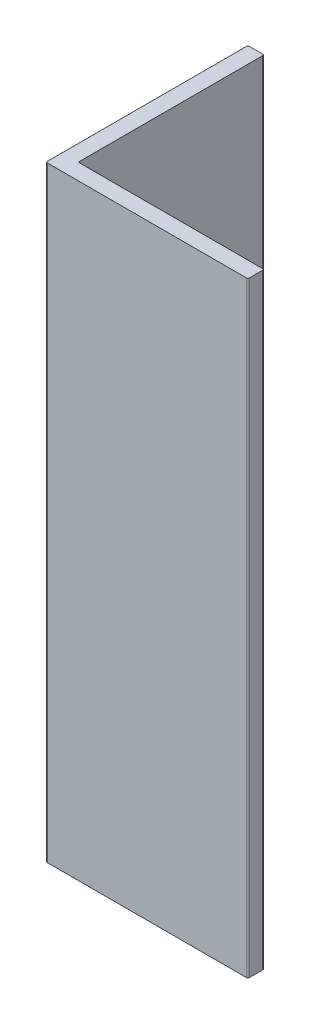
ISO-10303-21;
HEADER;
FILE_DESCRIPTION(('STEP AP214'),'2;1');
FILE_NAME('part.step','',(''),(''),'','','');
FILE_SCHEMA(('AUTOMOTIVE_DESIGN { 1 0 10303 214 1 1 1 1 }'));
ENDSEC;
DATA;
#1=APPLICATION_CONTEXT('core data for automotive mechanical design processes');
#2=APPLICATION_PROTOCOL_DEFINITION('international standard','automotive_design',2000,#1);
#3=PRODUCT_CONTEXT('',#1,'mechanical');
#4=PRODUCT('Part','Part','',(#3));
#5=PRODUCT_RELATED_PRODUCT_CATEGORY('part','',(#4));
#6=PRODUCT_DEFINITION_FORMATION('','',#4);
#7=PRODUCT_DEFINITION_CONTEXT('part definition',#1,'design');
#8=PRODUCT_DEFINITION('design','',#6,#7);
#9=PRODUCT_DEFINITION_SHAPE('','',#8);
#10=(LENGTH_UNIT() NAMED_UNIT(*) SI_UNIT(.MILLI.,.METRE.));
#11=(NAMED_UNIT(*) PLANE_ANGLE_UNIT() SI_UNIT($,.RADIAN.));
#12=(NAMED_UNIT(*) SI_UNIT($,.STERADIAN.) SOLID_ANGLE_UNIT());
#13=UNCERTAINTY_MEASURE_WITH_UNIT(LENGTH_MEASURE(1.E-05),#10,'distance_accuracy_value','');
#14=(GEOMETRIC_REPRESENTATION_CONTEXT(3) GLOBAL_UNCERTAINTY_ASSIGNED_CONTEXT((#13)) GLOBAL_UNIT_ASSIGNED_CONTEXT((#10,
#11,#12)) REPRESENTATION_CONTEXT('',''));
#15=CARTESIAN_POINT('',(0.,0.,0.));
#16=DIRECTION('',(0.,0.,1.));
#17=DIRECTION('',(1.,0.,0.));
#18=AXIS2_PLACEMENT_3D('',#15,#16,#17);
#19=CARTESIAN_POINT('',(0.,45.,0.));
#20=DIRECTION('',(1.,0.,0.));
#21=DIRECTION('',(0.,0.,-1.));
#22=AXIS2_PLACEMENT_3D('',#19,#20,#21);
#23=PLANE('',#22);
#24=DIRECTION('',(0.,0.,1.));
#25=VECTOR('',#24,1.);
#26=CARTESIAN_POINT('',(0.,45.,0.));
#27=LINE('',#26,#25);
#28=CARTESIAN_POINT('',(0.,45.,-14.9));
#29=VERTEX_POINT('',#28);
#30=CARTESIAN_POINT('',(0.,45.,-0.1));
#31=VERTEX_POINT('',#30);
#32=EDGE_CURVE('E141',#29,#31,#27,.T.);
#33=ORIENTED_EDGE('',*,*,#32,.F.);
#34=DIRECTION('',(0.,-1.,0.));
#35=VECTOR('',#34,1.);
#36=CARTESIAN_POINT('',(0.,45.,-14.9));
#37=LINE('',#36,#35);
#38=CARTESIAN_POINT('',(0.,0.,-14.9));
#39=VERTEX_POINT('',#38);
#40=EDGE_CURVE('E126',#29,#39,#37,.T.);
#41=ORIENTED_EDGE('',*,*,#40,.T.);
#42=DIRECTION('',(0.,0.,1.));
#43=VECTOR('',#42,1.);
#44=CARTESIAN_POINT('',(0.,0.,0.));
#45=LINE('',#44,#43);
#46=CARTESIAN_POINT('',(0.,0.,-0.1));
#47=VERTEX_POINT('',#46);
#48=EDGE_CURVE('E138',#39,#47,#45,.T.);
#49=ORIENTED_EDGE('',*,*,#48,.T.);
#50=DIRECTION('',(0.,-1.,0.));
#51=VECTOR('',#50,1.);
#52=CARTESIAN_POINT('',(0.,45.,-0.1));
#53=LINE('',#52,#51);
#54=EDGE_CURVE('E143',#47,#31,#53,.F.);
#55=ORIENTED_EDGE('',*,*,#54,.T.);
#56=EDGE_LOOP('',(#33,#41,#49,#55));
#57=FACE_BOUND('',#56,.T.);
#58=ADVANCED_FACE('F33',(#57),#23,.F.);
#59=CARTESIAN_POINT('',(0.,45.,0.));
#60=DIRECTION('',(0.,0.,-1.));
#61=DIRECTION('',(-1.,0.,0.));
#62=AXIS2_PLACEMENT_3D('',#59,#60,#61);
#63=PLANE('',#62);
#64=DIRECTION('',(1.,0.,0.));
#65=VECTOR('',#64,1.);
#66=CARTESIAN_POINT('',(0.,0.,0.));
#67=LINE('',#66,#65);
#68=CARTESIAN_POINT('',(0.1,0.,0.));
#69=VERTEX_POINT('',#68);
#70=CARTESIAN_POINT('',(14.9,0.,0.));
#71=VERTEX_POINT('',#70);
#72=EDGE_CURVE('E148',#69,#71,#67,.T.);
#73=ORIENTED_EDGE('',*,*,#72,.T.);
#74=DIRECTION('',(0.,-1.,0.));
#75=VECTOR('',#74,1.);
#76=CARTESIAN_POINT('',(14.9,45.,0.));
#77=LINE('',#76,#75);
#78=CARTESIAN_POINT('',(14.9,45.,0.));
#79=VERTEX_POINT('',#78);
#80=EDGE_CURVE('E202',#71,#79,#77,.F.);
#81=ORIENTED_EDGE('',*,*,#80,.T.);
#82=DIRECTION('',(1.,0.,0.));
#83=VECTOR('',#82,1.);
#84=CARTESIAN_POINT('',(0.,45.,0.));
#85=LINE('',#84,#83);
#86=CARTESIAN_POINT('',(0.1,45.,0.));
#87=VERTEX_POINT('',#86);
#88=EDGE_CURVE('E223',#87,#79,#85,.T.);
#89=ORIENTED_EDGE('',*,*,#88,.F.);
#90=DIRECTION('',(0.,-1.,0.));
#91=VECTOR('',#90,1.);
#92=CARTESIAN_POINT('',(0.1,45.,0.));
#93=LINE('',#92,#91);
#94=EDGE_CURVE('E199',#87,#69,#93,.T.);
#95=ORIENTED_EDGE('',*,*,#94,.T.);
#96=EDGE_LOOP('',(#73,#81,#89,#95));
#97=FACE_BOUND('',#96,.T.);
#98=ADVANCED_FACE('F233',(#97),#63,.F.);
#99=CARTESIAN_POINT('',(15.,45.,0.));
#100=DIRECTION('',(-1.,0.,0.));
#101=DIRECTION('',(0.,0.,1.));
#102=AXIS2_PLACEMENT_3D('',#99,#100,#101);
#103=PLANE('',#102);
#104=DIRECTION('',(0.,0.,-1.));
#105=VECTOR('',#104,1.);
#106=CARTESIAN_POINT('',(15.,0.,0.));
#107=LINE('',#106,#105);
#108=CARTESIAN_POINT('',(15.,0.,-0.0999999999999998));
#109=VERTEX_POINT('',#108);
#110=CARTESIAN_POINT('',(15.,0.,-1.1));
#111=VERTEX_POINT('',#110);
#112=EDGE_CURVE('E151',#109,#111,#107,.T.);
#113=ORIENTED_EDGE('',*,*,#112,.T.);
#114=DIRECTION('',(0.,-1.,0.));
#115=VECTOR('',#114,1.);
#116=CARTESIAN_POINT('',(15.,45.,-1.1));
#117=LINE('',#116,#115);
#118=CARTESIAN_POINT('',(15.,45.,-1.1));
#119=VERTEX_POINT('',#118);
#120=EDGE_CURVE('E197',#111,#119,#117,.F.);
#121=ORIENTED_EDGE('',*,*,#120,.T.);
#122=DIRECTION('',(0.,0.,-1.));
#123=VECTOR('',#122,1.);
#124=CARTESIAN_POINT('',(15.,45.,0.));
#125=LINE('',#124,#123);
#126=CARTESIAN_POINT('',(15.,45.,-0.0999999999999998));
#127=VERTEX_POINT('',#126);
#128=EDGE_CURVE('E218',#127,#119,#125,.T.);
#129=ORIENTED_EDGE('',*,*,#128,.F.);
#130=DIRECTION('',(0.,-1.,0.));
#131=VECTOR('',#130,1.);
#132=CARTESIAN_POINT('',(15.,45.,-0.0999999999999998));
#133=LINE('',#132,#131);
#134=EDGE_CURVE('E194',#127,#109,#133,.T.);
#135=ORIENTED_EDGE('',*,*,#134,.T.);
#136=EDGE_LOOP('',(#113,#121,#129,#135));
#137=FACE_BOUND('',#136,.T.);
#138=ADVANCED_FACE('F242',(#137),#103,.F.);
#139=CARTESIAN_POINT('',(15.,45.,-1.2));
#140=DIRECTION('',(0.,0.,1.));
#141=DIRECTION('',(1.,0.,0.));
#142=AXIS2_PLACEMENT_3D('',#139,#140,#141);
#143=PLANE('',#142);
#144=DIRECTION('',(-1.,0.,0.));
#145=VECTOR('',#144,1.);
#146=CARTESIAN_POINT('',(15.,0.,-1.2));
#147=LINE('',#146,#145);
#148=CARTESIAN_POINT('',(14.9,0.,-1.2));
#149=VERTEX_POINT('',#148);
#150=CARTESIAN_POINT('',(1.3,0.,-1.2));
#151=VERTEX_POINT('',#150);
#152=EDGE_CURVE('E159',#149,#151,#147,.T.);
#153=ORIENTED_EDGE('',*,*,#152,.T.);
#154=DIRECTION('',(0.,-1.,0.));
#155=VECTOR('',#154,1.);
#156=CARTESIAN_POINT('',(1.3,45.,-1.2));
#157=LINE('',#156,#155);
#158=CARTESIAN_POINT('',(1.3,45.,-1.2));
#159=VERTEX_POINT('',#158);
#160=EDGE_CURVE('E192',#151,#159,#157,.F.);
#161=ORIENTED_EDGE('',*,*,#160,.T.);
#162=DIRECTION('',(-1.,0.,0.));
#163=VECTOR('',#162,1.);
#164=CARTESIAN_POINT('',(15.,45.,-1.2));
#165=LINE('',#164,#163);
#166=CARTESIAN_POINT('',(14.9,45.,-1.2));
#167=VERTEX_POINT('',#166);
#168=EDGE_CURVE('E216',#167,#159,#165,.T.);
#169=ORIENTED_EDGE('',*,*,#168,.F.);
#170=DIRECTION('',(0.,-1.,0.));
#171=VECTOR('',#170,1.);
#172=CARTESIAN_POINT('',(14.9,45.,-1.2));
#173=LINE('',#172,#171);
#174=EDGE_CURVE('E189',#167,#149,#173,.T.);
#175=ORIENTED_EDGE('',*,*,#174,.T.);
#176=EDGE_LOOP('',(#153,#161,#169,#175));
#177=FACE_BOUND('',#176,.T.);
#178=ADVANCED_FACE('F209',(#177),#143,.F.);
#179=CARTESIAN_POINT('',(1.2,45.,-15.));
#180=DIRECTION('',(-1.,0.,0.));
#181=DIRECTION('',(0.,0.,1.));
#182=AXIS2_PLACEMENT_3D('',#179,#180,#181);
#183=PLANE('',#182);
#184=DIRECTION('',(0.,0.,-1.));
#185=VECTOR('',#184,1.);
#186=CARTESIAN_POINT('',(1.2,45.,-15.));
#187=LINE('',#186,#185);
#188=CARTESIAN_POINT('',(1.2,45.,-1.3));
#189=VERTEX_POINT('',#188);
#190=CARTESIAN_POINT('',(1.2,45.,-14.9));
#191=VERTEX_POINT('',#190);
#192=EDGE_CURVE('E214',#189,#191,#187,.T.);
#193=ORIENTED_EDGE('',*,*,#192,.F.);
#194=DIRECTION('',(0.,-1.,0.));
#195=VECTOR('',#194,1.);
#196=CARTESIAN_POINT('',(1.2,0.,-1.3));
#197=LINE('',#196,#195);
#198=CARTESIAN_POINT('',(1.2,0.,-1.3));
#199=VERTEX_POINT('',#198);
#200=EDGE_CURVE('E186',#189,#199,#197,.T.);
#201=ORIENTED_EDGE('',*,*,#200,.T.);
#202=DIRECTION('',(0.,0.,-1.));
#203=VECTOR('',#202,1.);
#204=CARTESIAN_POINT('',(1.2,0.,-15.));
#205=LINE('',#204,#203);
#206=CARTESIAN_POINT('',(1.2,0.,-14.9));
#207=VERTEX_POINT('',#206);
#208=EDGE_CURVE('E162',#199,#207,#205,.T.);
#209=ORIENTED_EDGE('',*,*,#208,.T.);
#210=DIRECTION('',(0.,-1.,0.));
#211=VECTOR('',#210,1.);
#212=CARTESIAN_POINT('',(1.2,45.,-14.9));
#213=LINE('',#212,#211);
#214=EDGE_CURVE('E48',#207,#191,#213,.F.);
#215=ORIENTED_EDGE('',*,*,#214,.T.);
#216=EDGE_LOOP('',(#193,#201,#209,#215));
#217=FACE_BOUND('',#216,.T.);
#218=ADVANCED_FACE('F213',(#217),#183,.F.);
#219=CARTESIAN_POINT('',(0.,45.,-15.));
#220=DIRECTION('',(0.,0.,1.));
#221=DIRECTION('',(1.,0.,0.));
#222=AXIS2_PLACEMENT_3D('',#219,#220,#221);
#223=PLANE('',#222);
#224=DIRECTION('',(-1.,0.,0.));
#225=VECTOR('',#224,1.);
#226=CARTESIAN_POINT('',(0.,0.,-15.));
#227=LINE('',#226,#225);
#228=CARTESIAN_POINT('',(1.1,0.,-15.));
#229=VERTEX_POINT('',#228);
#230=CARTESIAN_POINT('',(0.1,0.,-15.));
#231=VERTEX_POINT('',#230);
#232=EDGE_CURVE('E164',#229,#231,#227,.T.);
#233=ORIENTED_EDGE('',*,*,#232,.T.);
#234=DIRECTION('',(0.,-1.,0.));
#235=VECTOR('',#234,1.);
#236=CARTESIAN_POINT('',(0.1,45.,-15.));
#237=LINE('',#236,#235);
#238=CARTESIAN_POINT('',(0.1,45.,-15.));
#239=VERTEX_POINT('',#238);
#240=EDGE_CURVE('E127',#231,#239,#237,.F.);
#241=ORIENTED_EDGE('',*,*,#240,.T.);
#242=DIRECTION('',(-1.,0.,0.));
#243=VECTOR('',#242,1.);
#244=CARTESIAN_POINT('',(0.,45.,-15.));
#245=LINE('',#244,#243);
#246=CARTESIAN_POINT('',(1.1,45.,-15.));
#247=VERTEX_POINT('',#246);
#248=EDGE_CURVE('E154',#247,#239,#245,.T.);
#249=ORIENTED_EDGE('',*,*,#248,.F.);
#250=DIRECTION('',(0.,-1.,0.));
#251=VECTOR('',#250,1.);
#252=CARTESIAN_POINT('',(1.1,45.,-15.));
#253=LINE('',#252,#251);
#254=EDGE_CURVE('E132',#247,#229,#253,.T.);
#255=ORIENTED_EDGE('',*,*,#254,.T.);
#256=EDGE_LOOP('',(#233,#241,#249,#255));
#257=FACE_BOUND('',#256,.T.);
#258=ADVANCED_FACE('F271',(#257),#223,.F.);
#259=CARTESIAN_POINT('',(0.,45.,0.));
#260=DIRECTION('',(0.,-1.,0.));
#261=DIRECTION('',(0.,0.,-1.));
#262=AXIS2_PLACEMENT_3D('',#259,#260,#261);
#263=PLANE('',#262);
#264=ORIENTED_EDGE('',*,*,#248,.T.);
#265=CARTESIAN_POINT('',(0.1,45.,-14.9));
#266=DIRECTION('',(0.,-1.,0.));
#267=DIRECTION('',(0.,0.,-1.));
#268=AXIS2_PLACEMENT_3D('',#265,#266,#267);
#269=CIRCLE('',#268,0.1);
#270=EDGE_CURVE('E183',#239,#29,#269,.F.);
#271=ORIENTED_EDGE('',*,*,#270,.T.);
#272=ORIENTED_EDGE('',*,*,#32,.T.);
#273=CARTESIAN_POINT('',(0.1,45.,-0.1));
#274=DIRECTION('',(0.,-1.,0.));
#275=DIRECTION('',(0.,0.,-1.));
#276=AXIS2_PLACEMENT_3D('',#273,#274,#275);
#277=CIRCLE('',#276,0.1);
#278=EDGE_CURVE('E177',#31,#87,#277,.F.);
#279=ORIENTED_EDGE('',*,*,#278,.T.);
#280=ORIENTED_EDGE('',*,*,#88,.T.);
#281=CARTESIAN_POINT('',(14.9,45.,-0.1));
#282=DIRECTION('',(0.,-1.,0.));
#283=DIRECTION('',(0.,0.,-1.));
#284=AXIS2_PLACEMENT_3D('',#281,#282,#283);
#285=CIRCLE('',#284,0.1);
#286=EDGE_CURVE('E179',#79,#127,#285,.F.);
#287=ORIENTED_EDGE('',*,*,#286,.T.);
#288=ORIENTED_EDGE('',*,*,#128,.T.);
#289=CARTESIAN_POINT('',(14.9,45.,-1.1));
#290=DIRECTION('',(0.,-1.,0.));
#291=DIRECTION('',(0.,0.,-1.));
#292=AXIS2_PLACEMENT_3D('',#289,#290,#291);
#293=CIRCLE('',#292,0.1);
#294=EDGE_CURVE('E181',#119,#167,#293,.F.);
#295=ORIENTED_EDGE('',*,*,#294,.T.);
#296=ORIENTED_EDGE('',*,*,#168,.T.);
#297=CARTESIAN_POINT('',(1.3,45.,-1.3));
#298=DIRECTION('',(0.,-1.,0.));
#299=DIRECTION('',(0.,0.,-1.));
#300=AXIS2_PLACEMENT_3D('',#297,#298,#299);
#301=CIRCLE('',#300,0.1);
#302=EDGE_CURVE('E11',#159,#189,#301,.T.);
#303=ORIENTED_EDGE('',*,*,#302,.T.);
#304=ORIENTED_EDGE('',*,*,#192,.T.);
#305=CARTESIAN_POINT('',(1.1,45.,-14.9));
#306=DIRECTION('',(0.,-1.,0.));
#307=DIRECTION('',(0.,0.,-1.));
#308=AXIS2_PLACEMENT_3D('',#305,#306,#307);
#309=CIRCLE('',#308,0.1);
#310=EDGE_CURVE('E175',#191,#247,#309,.F.);
#311=ORIENTED_EDGE('',*,*,#310,.T.);
#312=EDGE_LOOP('',(#264,#271,#272,#279,#280,#287,#288,#295,#296,#303,#304,#311));
#313=FACE_BOUND('',#312,.T.);
#314=ADVANCED_FACE('F227',(#313),#263,.F.);
#315=CARTESIAN_POINT('',(0.,0.,0.));
#316=DIRECTION('',(0.,-1.,0.));
#317=DIRECTION('',(0.,0.,-1.));
#318=AXIS2_PLACEMENT_3D('',#315,#316,#317);
#319=PLANE('',#318);
#320=ORIENTED_EDGE('',*,*,#48,.F.);
#321=CARTESIAN_POINT('',(0.1,0.,-14.9));
#322=DIRECTION('',(0.,-1.,0.));
#323=DIRECTION('',(0.,0.,-1.));
#324=AXIS2_PLACEMENT_3D('',#321,#322,#323);
#325=CIRCLE('',#324,0.1);
#326=EDGE_CURVE('E122',#39,#231,#325,.T.);
#327=ORIENTED_EDGE('',*,*,#326,.T.);
#328=ORIENTED_EDGE('',*,*,#232,.F.);
#329=CARTESIAN_POINT('',(1.1,0.,-14.9));
#330=DIRECTION('',(0.,-1.,0.));
#331=DIRECTION('',(0.,0.,-1.));
#332=AXIS2_PLACEMENT_3D('',#329,#330,#331);
#333=CIRCLE('',#332,0.1);
#334=EDGE_CURVE('E142',#229,#207,#333,.T.);
#335=ORIENTED_EDGE('',*,*,#334,.T.);
#336=ORIENTED_EDGE('',*,*,#208,.F.);
#337=CARTESIAN_POINT('',(1.3,0.,-1.3));
#338=DIRECTION('',(0.,-1.,0.));
#339=DIRECTION('',(0.,0.,-1.));
#340=AXIS2_PLACEMENT_3D('',#337,#338,#339);
#341=CIRCLE('',#340,0.1);
#342=EDGE_CURVE('E41',#199,#151,#341,.F.);
#343=ORIENTED_EDGE('',*,*,#342,.T.);
#344=ORIENTED_EDGE('',*,*,#152,.F.);
#345=CARTESIAN_POINT('',(14.9,0.,-1.1));
#346=DIRECTION('',(0.,-1.,0.));
#347=DIRECTION('',(0.,0.,-1.));
#348=AXIS2_PLACEMENT_3D('',#345,#346,#347);
#349=CIRCLE('',#348,0.1);
#350=EDGE_CURVE('E133',#149,#111,#349,.T.);
#351=ORIENTED_EDGE('',*,*,#350,.T.);
#352=ORIENTED_EDGE('',*,*,#112,.F.);
#353=CARTESIAN_POINT('',(14.9,0.,-0.1));
#354=DIRECTION('',(0.,-1.,0.));
#355=DIRECTION('',(0.,0.,-1.));
#356=AXIS2_PLACEMENT_3D('',#353,#354,#355);
#357=CIRCLE('',#356,0.1);
#358=EDGE_CURVE('E169',#109,#71,#357,.T.);
#359=ORIENTED_EDGE('',*,*,#358,.T.);
#360=ORIENTED_EDGE('',*,*,#72,.F.);
#361=CARTESIAN_POINT('',(0.1,0.,-0.1));
#362=DIRECTION('',(0.,-1.,0.));
#363=DIRECTION('',(0.,0.,-1.));
#364=AXIS2_PLACEMENT_3D('',#361,#362,#363);
#365=CIRCLE('',#364,0.1);
#366=EDGE_CURVE('E147',#69,#47,#365,.T.);
#367=ORIENTED_EDGE('',*,*,#366,.T.);
#368=EDGE_LOOP('',(#320,#327,#328,#335,#336,#343,#344,#351,#352,#359,#360,#367));
#369=FACE_BOUND('',#368,.T.);
#370=ADVANCED_FACE('F145',(#369),#319,.T.);
#371=CARTESIAN_POINT('',(0.1,45.,-14.9));
#372=DIRECTION('',(0.,-1.,0.));
#373=DIRECTION('',(0.,0.,-1.));
#374=AXIS2_PLACEMENT_3D('',#371,#372,#373);
#375=CYLINDRICAL_SURFACE('',#374,0.1);
#376=ORIENTED_EDGE('',*,*,#270,.F.);
#377=ORIENTED_EDGE('',*,*,#240,.F.);
#378=ORIENTED_EDGE('',*,*,#326,.F.);
#379=ORIENTED_EDGE('',*,*,#40,.F.);
#380=EDGE_LOOP('',(#376,#377,#378,#379));
#381=FACE_BOUND('',#380,.T.);
#382=ADVANCED_FACE('F125',(#381),#375,.T.);
#383=CARTESIAN_POINT('',(1.3,45.,-1.3));
#384=DIRECTION('',(0.,1.,0.));
#385=DIRECTION('',(0.,0.,1.));
#386=AXIS2_PLACEMENT_3D('',#383,#384,#385);
#387=CYLINDRICAL_SURFACE('',#386,0.1);
#388=ORIENTED_EDGE('',*,*,#302,.F.);
#389=ORIENTED_EDGE('',*,*,#160,.F.);
#390=ORIENTED_EDGE('',*,*,#342,.F.);
#391=ORIENTED_EDGE('',*,*,#200,.F.);
#392=EDGE_LOOP('',(#388,#389,#390,#391));
#393=FACE_BOUND('',#392,.T.);
#394=ADVANCED_FACE('F212',(#393),#387,.F.);
#395=CARTESIAN_POINT('',(14.9,45.,-1.1));
#396=DIRECTION('',(0.,-1.,0.));
#397=DIRECTION('',(0.,0.,-1.));
#398=AXIS2_PLACEMENT_3D('',#395,#396,#397);
#399=CYLINDRICAL_SURFACE('',#398,0.1);
#400=ORIENTED_EDGE('',*,*,#294,.F.);
#401=ORIENTED_EDGE('',*,*,#120,.F.);
#402=ORIENTED_EDGE('',*,*,#350,.F.);
#403=ORIENTED_EDGE('',*,*,#174,.F.);
#404=EDGE_LOOP('',(#400,#401,#402,#403));
#405=FACE_BOUND('',#404,.T.);
#406=ADVANCED_FACE('F246',(#405),#399,.T.);
#407=CARTESIAN_POINT('',(14.9,45.,-0.1));
#408=DIRECTION('',(0.,-1.,0.));
#409=DIRECTION('',(0.,0.,-1.));
#410=AXIS2_PLACEMENT_3D('',#407,#408,#409);
#411=CYLINDRICAL_SURFACE('',#410,0.1);
#412=ORIENTED_EDGE('',*,*,#286,.F.);
#413=ORIENTED_EDGE('',*,*,#80,.F.);
#414=ORIENTED_EDGE('',*,*,#358,.F.);
#415=ORIENTED_EDGE('',*,*,#134,.F.);
#416=EDGE_LOOP('',(#412,#413,#414,#415));
#417=FACE_BOUND('',#416,.T.);
#418=ADVANCED_FACE('F239',(#417),#411,.T.);
#419=CARTESIAN_POINT('',(0.1,45.,-0.1));
#420=DIRECTION('',(0.,-1.,0.));
#421=DIRECTION('',(0.,0.,-1.));
#422=AXIS2_PLACEMENT_3D('',#419,#420,#421);
#423=CYLINDRICAL_SURFACE('',#422,0.1);
#424=ORIENTED_EDGE('',*,*,#278,.F.);
#425=ORIENTED_EDGE('',*,*,#54,.F.);
#426=ORIENTED_EDGE('',*,*,#366,.F.);
#427=ORIENTED_EDGE('',*,*,#94,.F.);
#428=EDGE_LOOP('',(#424,#425,#426,#427));
#429=FACE_BOUND('',#428,.T.);
#430=ADVANCED_FACE('F231',(#429),#423,.T.);
#431=CARTESIAN_POINT('',(1.1,45.,-14.9));
#432=DIRECTION('',(0.,-1.,0.));
#433=DIRECTION('',(0.,0.,-1.));
#434=AXIS2_PLACEMENT_3D('',#431,#432,#433);
#435=CYLINDRICAL_SURFACE('',#434,0.1);
#436=ORIENTED_EDGE('',*,*,#310,.F.);
#437=ORIENTED_EDGE('',*,*,#214,.F.);
#438=ORIENTED_EDGE('',*,*,#334,.F.);
#439=ORIENTED_EDGE('',*,*,#254,.F.);
#440=EDGE_LOOP('',(#436,#437,#438,#439));
#441=FACE_BOUND('',#440,.T.);
#442=ADVANCED_FACE('F35',(#441),#435,.T.);
#443=CLOSED_SHELL('',(#58,#98,#138,#178,#218,#258,#314,#370,#382,#394,#406,#418,#430,#442));
#444=MANIFOLD_SOLID_BREP('B2',#443);
#445=ADVANCED_BREP_SHAPE_REPRESENTATION('',(#18,#444),#14);
#446=SHAPE_DEFINITION_REPRESENTATION(#9,#445);
ENDSEC;
END-ISO-10303-21;
